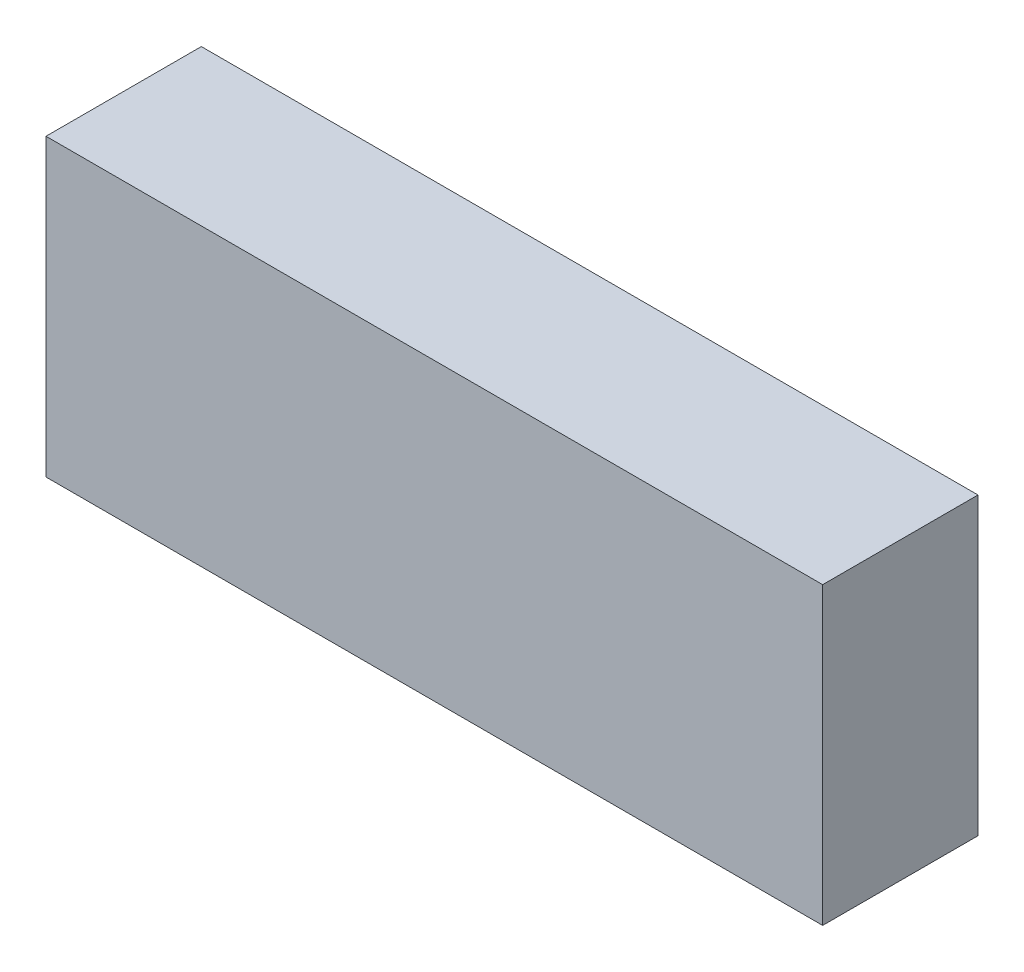
ISO-10303-21;
HEADER;
FILE_DESCRIPTION(('STEP AP214'),'2;1');
FILE_NAME('part.step','',(''),(''),'','','');
FILE_SCHEMA(('AUTOMOTIVE_DESIGN { 1 0 10303 214 1 1 1 1 }'));
ENDSEC;
DATA;
#1=APPLICATION_CONTEXT('core data for automotive mechanical design processes');
#2=APPLICATION_PROTOCOL_DEFINITION('international standard','automotive_design',2000,#1);
#3=PRODUCT_CONTEXT('',#1,'mechanical');
#4=PRODUCT('Part','Part','',(#3));
#5=PRODUCT_RELATED_PRODUCT_CATEGORY('part','',(#4));
#6=PRODUCT_DEFINITION_FORMATION('','',#4);
#7=PRODUCT_DEFINITION_CONTEXT('part definition',#1,'design');
#8=PRODUCT_DEFINITION('design','',#6,#7);
#9=PRODUCT_DEFINITION_SHAPE('','',#8);
#10=(LENGTH_UNIT() NAMED_UNIT(*) SI_UNIT(.MILLI.,.METRE.));
#11=(NAMED_UNIT(*) PLANE_ANGLE_UNIT() SI_UNIT($,.RADIAN.));
#12=(NAMED_UNIT(*) SI_UNIT($,.STERADIAN.) SOLID_ANGLE_UNIT());
#13=UNCERTAINTY_MEASURE_WITH_UNIT(LENGTH_MEASURE(1.E-05),#10,'distance_accuracy_value','');
#14=(GEOMETRIC_REPRESENTATION_CONTEXT(3) GLOBAL_UNCERTAINTY_ASSIGNED_CONTEXT((#13)) GLOBAL_UNIT_ASSIGNED_CONTEXT((#10,
#11,#12)) REPRESENTATION_CONTEXT('',''));
#15=CARTESIAN_POINT('',(0.,0.,0.));
#16=DIRECTION('',(0.,0.,1.));
#17=DIRECTION('',(1.,0.,0.));
#18=AXIS2_PLACEMENT_3D('',#15,#16,#17);
#19=CARTESIAN_POINT('',(25.,-9.5,10.));
#20=DIRECTION('',(-1.,0.,0.));
#21=DIRECTION('',(0.,0.,1.));
#22=AXIS2_PLACEMENT_3D('',#19,#20,#21);
#23=PLANE('',#22);
#24=DIRECTION('',(0.,1.,0.));
#25=VECTOR('',#24,1.);
#26=CARTESIAN_POINT('',(25.,-9.5,0.));
#27=LINE('',#26,#25);
#28=CARTESIAN_POINT('',(25.,-9.5,0.));
#29=VERTEX_POINT('',#28);
#30=CARTESIAN_POINT('',(25.,9.5,0.));
#31=VERTEX_POINT('',#30);
#32=EDGE_CURVE('E107',#29,#31,#27,.T.);
#33=ORIENTED_EDGE('',*,*,#32,.T.);
#34=DIRECTION('',(0.,0.,-1.));
#35=VECTOR('',#34,1.);
#36=CARTESIAN_POINT('',(25.,9.5,10.));
#37=LINE('',#36,#35);
#38=CARTESIAN_POINT('',(25.,9.5,10.));
#39=VERTEX_POINT('',#38);
#40=EDGE_CURVE('E11',#39,#31,#37,.T.);
#41=ORIENTED_EDGE('',*,*,#40,.F.);
#42=DIRECTION('',(0.,1.,0.));
#43=VECTOR('',#42,1.);
#44=CARTESIAN_POINT('',(25.,-9.5,10.));
#45=LINE('',#44,#43);
#46=CARTESIAN_POINT('',(25.,-9.5,10.));
#47=VERTEX_POINT('',#46);
#48=EDGE_CURVE('E91',#47,#39,#45,.T.);
#49=ORIENTED_EDGE('',*,*,#48,.F.);
#50=DIRECTION('',(0.,0.,-1.));
#51=VECTOR('',#50,1.);
#52=CARTESIAN_POINT('',(25.,-9.5,10.));
#53=LINE('',#52,#51);
#54=EDGE_CURVE('E103',#47,#29,#53,.T.);
#55=ORIENTED_EDGE('',*,*,#54,.T.);
#56=EDGE_LOOP('',(#33,#41,#49,#55));
#57=FACE_BOUND('',#56,.T.);
#58=ADVANCED_FACE('F39',(#57),#23,.F.);
#59=CARTESIAN_POINT('',(-25.,9.5,10.));
#60=DIRECTION('',(0.,-1.,0.));
#61=DIRECTION('',(0.,0.,-1.));
#62=AXIS2_PLACEMENT_3D('',#59,#60,#61);
#63=PLANE('',#62);
#64=DIRECTION('',(-1.,0.,0.));
#65=VECTOR('',#64,1.);
#66=CARTESIAN_POINT('',(-25.,9.5,0.));
#67=LINE('',#66,#65);
#68=CARTESIAN_POINT('',(-25.,9.5,0.));
#69=VERTEX_POINT('',#68);
#70=EDGE_CURVE('E96',#31,#69,#67,.T.);
#71=ORIENTED_EDGE('',*,*,#70,.T.);
#72=DIRECTION('',(0.,0.,-1.));
#73=VECTOR('',#72,1.);
#74=CARTESIAN_POINT('',(-25.,9.5,10.));
#75=LINE('',#74,#73);
#76=CARTESIAN_POINT('',(-25.,9.5,10.));
#77=VERTEX_POINT('',#76);
#78=EDGE_CURVE('E48',#77,#69,#75,.T.);
#79=ORIENTED_EDGE('',*,*,#78,.F.);
#80=DIRECTION('',(-1.,0.,0.));
#81=VECTOR('',#80,1.);
#82=CARTESIAN_POINT('',(-25.,9.5,10.));
#83=LINE('',#82,#81);
#84=EDGE_CURVE('E86',#39,#77,#83,.T.);
#85=ORIENTED_EDGE('',*,*,#84,.F.);
#86=ORIENTED_EDGE('',*,*,#40,.T.);
#87=EDGE_LOOP('',(#71,#79,#85,#86));
#88=FACE_BOUND('',#87,.T.);
#89=ADVANCED_FACE('F95',(#88),#63,.F.);
#90=CARTESIAN_POINT('',(-25.,-9.5,10.));
#91=DIRECTION('',(1.,0.,0.));
#92=DIRECTION('',(0.,0.,-1.));
#93=AXIS2_PLACEMENT_3D('',#90,#91,#92);
#94=PLANE('',#93);
#95=DIRECTION('',(0.,-1.,0.));
#96=VECTOR('',#95,1.);
#97=CARTESIAN_POINT('',(-25.,-9.5,0.));
#98=LINE('',#97,#96);
#99=CARTESIAN_POINT('',(-25.,-9.5,0.));
#100=VERTEX_POINT('',#99);
#101=EDGE_CURVE('E73',#69,#100,#98,.T.);
#102=ORIENTED_EDGE('',*,*,#101,.T.);
#103=DIRECTION('',(0.,0.,-1.));
#104=VECTOR('',#103,1.);
#105=CARTESIAN_POINT('',(-25.,-9.5,10.));
#106=LINE('',#105,#104);
#107=CARTESIAN_POINT('',(-25.,-9.5,10.));
#108=VERTEX_POINT('',#107);
#109=EDGE_CURVE('E98',#108,#100,#106,.T.);
#110=ORIENTED_EDGE('',*,*,#109,.F.);
#111=DIRECTION('',(0.,-1.,0.));
#112=VECTOR('',#111,1.);
#113=CARTESIAN_POINT('',(-25.,-9.5,10.));
#114=LINE('',#113,#112);
#115=EDGE_CURVE('E89',#77,#108,#114,.T.);
#116=ORIENTED_EDGE('',*,*,#115,.F.);
#117=ORIENTED_EDGE('',*,*,#78,.T.);
#118=EDGE_LOOP('',(#102,#110,#116,#117));
#119=FACE_BOUND('',#118,.T.);
#120=ADVANCED_FACE('F99',(#119),#94,.F.);
#121=CARTESIAN_POINT('',(-25.,-9.5,10.));
#122=DIRECTION('',(0.,1.,0.));
#123=DIRECTION('',(0.,0.,1.));
#124=AXIS2_PLACEMENT_3D('',#121,#122,#123);
#125=PLANE('',#124);
#126=DIRECTION('',(1.,0.,0.));
#127=VECTOR('',#126,1.);
#128=CARTESIAN_POINT('',(-25.,-9.5,0.));
#129=LINE('',#128,#127);
#130=EDGE_CURVE('E79',#100,#29,#129,.T.);
#131=ORIENTED_EDGE('',*,*,#130,.T.);
#132=ORIENTED_EDGE('',*,*,#54,.F.);
#133=DIRECTION('',(1.,0.,0.));
#134=VECTOR('',#133,1.);
#135=CARTESIAN_POINT('',(-25.,-9.5,10.));
#136=LINE('',#135,#134);
#137=EDGE_CURVE('E56',#108,#47,#136,.T.);
#138=ORIENTED_EDGE('',*,*,#137,.F.);
#139=ORIENTED_EDGE('',*,*,#109,.T.);
#140=EDGE_LOOP('',(#131,#132,#138,#139));
#141=FACE_BOUND('',#140,.T.);
#142=ADVANCED_FACE('F120',(#141),#125,.F.);
#143=CARTESIAN_POINT('',(0.,0.,10.));
#144=DIRECTION('',(0.,0.,-1.));
#145=DIRECTION('',(-1.,0.,0.));
#146=AXIS2_PLACEMENT_3D('',#143,#144,#145);
#147=PLANE('',#146);
#148=ORIENTED_EDGE('',*,*,#48,.T.);
#149=ORIENTED_EDGE('',*,*,#84,.T.);
#150=ORIENTED_EDGE('',*,*,#115,.T.);
#151=ORIENTED_EDGE('',*,*,#137,.T.);
#152=EDGE_LOOP('',(#148,#149,#150,#151));
#153=FACE_BOUND('',#152,.T.);
#154=ADVANCED_FACE('F87',(#153),#147,.F.);
#155=CARTESIAN_POINT('',(0.,0.,0.));
#156=DIRECTION('',(0.,0.,-1.));
#157=DIRECTION('',(-1.,0.,0.));
#158=AXIS2_PLACEMENT_3D('',#155,#156,#157);
#159=PLANE('',#158);
#160=ORIENTED_EDGE('',*,*,#32,.F.);
#161=ORIENTED_EDGE('',*,*,#130,.F.);
#162=ORIENTED_EDGE('',*,*,#101,.F.);
#163=ORIENTED_EDGE('',*,*,#70,.F.);
#164=EDGE_LOOP('',(#160,#161,#162,#163));
#165=FACE_BOUND('',#164,.T.);
#166=ADVANCED_FACE('F123',(#165),#159,.T.);
#167=CLOSED_SHELL('',(#58,#89,#120,#142,#154,#166));
#168=MANIFOLD_SOLID_BREP('B2',#167);
#169=ADVANCED_BREP_SHAPE_REPRESENTATION('',(#18,#168),#14);
#170=SHAPE_DEFINITION_REPRESENTATION(#9,#169);
ENDSEC;
END-ISO-10303-21;
